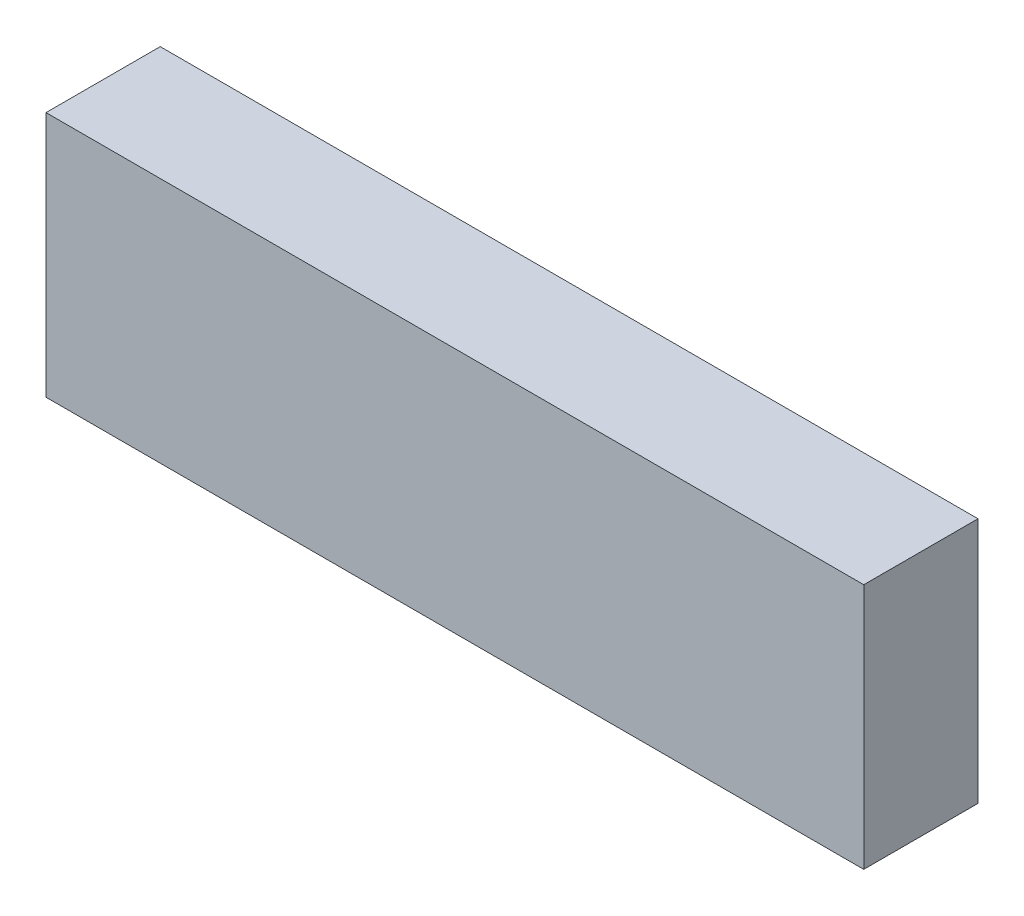
ISO-10303-21;
HEADER;
FILE_DESCRIPTION(('STEP AP214'),'2;1');
FILE_NAME('part.step','',(''),(''),'','','');
FILE_SCHEMA(('AUTOMOTIVE_DESIGN { 1 0 10303 214 1 1 1 1 }'));
ENDSEC;
DATA;
#1=APPLICATION_CONTEXT('core data for automotive mechanical design processes');
#2=APPLICATION_PROTOCOL_DEFINITION('international standard','automotive_design',2000,#1);
#3=PRODUCT_CONTEXT('',#1,'mechanical');
#4=PRODUCT('Part','Part','',(#3));
#5=PRODUCT_RELATED_PRODUCT_CATEGORY('part','',(#4));
#6=PRODUCT_DEFINITION_FORMATION('','',#4);
#7=PRODUCT_DEFINITION_CONTEXT('part definition',#1,'design');
#8=PRODUCT_DEFINITION('design','',#6,#7);
#9=PRODUCT_DEFINITION_SHAPE('','',#8);
#10=(LENGTH_UNIT() NAMED_UNIT(*) SI_UNIT(.MILLI.,.METRE.));
#11=(NAMED_UNIT(*) PLANE_ANGLE_UNIT() SI_UNIT($,.RADIAN.));
#12=(NAMED_UNIT(*) SI_UNIT($,.STERADIAN.) SOLID_ANGLE_UNIT());
#13=UNCERTAINTY_MEASURE_WITH_UNIT(LENGTH_MEASURE(1.E-05),#10,'distance_accuracy_value','');
#14=(GEOMETRIC_REPRESENTATION_CONTEXT(3) GLOBAL_UNCERTAINTY_ASSIGNED_CONTEXT((#13)) GLOBAL_UNIT_ASSIGNED_CONTEXT((#10,
#11,#12)) REPRESENTATION_CONTEXT('',''));
#15=CARTESIAN_POINT('',(0.,0.,0.));
#16=DIRECTION('',(0.,0.,1.));
#17=DIRECTION('',(1.,0.,0.));
#18=AXIS2_PLACEMENT_3D('',#15,#16,#17);
#19=CARTESIAN_POINT('',(68.,-20.5,9.5));
#20=DIRECTION('',(-1.,0.,0.));
#21=DIRECTION('',(0.,0.,1.));
#22=AXIS2_PLACEMENT_3D('',#19,#20,#21);
#23=PLANE('',#22);
#24=DIRECTION('',(0.,1.,0.));
#25=VECTOR('',#24,1.);
#26=CARTESIAN_POINT('',(68.,-20.5,-9.5));
#27=LINE('',#26,#25);
#28=CARTESIAN_POINT('',(68.,-20.5,-9.5));
#29=VERTEX_POINT('',#28);
#30=CARTESIAN_POINT('',(68.,20.5,-9.5));
#31=VERTEX_POINT('',#30);
#32=EDGE_CURVE('E99',#29,#31,#27,.T.);
#33=ORIENTED_EDGE('',*,*,#32,.T.);
#34=DIRECTION('',(0.,0.,-1.));
#35=VECTOR('',#34,1.);
#36=CARTESIAN_POINT('',(68.,20.5,9.5));
#37=LINE('',#36,#35);
#38=CARTESIAN_POINT('',(68.,20.5,9.5));
#39=VERTEX_POINT('',#38);
#40=EDGE_CURVE('E11',#39,#31,#37,.T.);
#41=ORIENTED_EDGE('',*,*,#40,.F.);
#42=DIRECTION('',(0.,1.,0.));
#43=VECTOR('',#42,1.);
#44=CARTESIAN_POINT('',(68.,-20.5,9.5));
#45=LINE('',#44,#43);
#46=CARTESIAN_POINT('',(68.,-20.5,9.5));
#47=VERTEX_POINT('',#46);
#48=EDGE_CURVE('E87',#47,#39,#45,.T.);
#49=ORIENTED_EDGE('',*,*,#48,.F.);
#50=DIRECTION('',(0.,0.,-1.));
#51=VECTOR('',#50,1.);
#52=CARTESIAN_POINT('',(68.,-20.5,9.5));
#53=LINE('',#52,#51);
#54=EDGE_CURVE('E95',#47,#29,#53,.T.);
#55=ORIENTED_EDGE('',*,*,#54,.T.);
#56=EDGE_LOOP('',(#33,#41,#49,#55));
#57=FACE_BOUND('',#56,.T.);
#58=ADVANCED_FACE('F36',(#57),#23,.F.);
#59=CARTESIAN_POINT('',(-68.,20.5,9.5));
#60=DIRECTION('',(0.,-1.,0.));
#61=DIRECTION('',(0.,0.,-1.));
#62=AXIS2_PLACEMENT_3D('',#59,#60,#61);
#63=PLANE('',#62);
#64=DIRECTION('',(-1.,0.,0.));
#65=VECTOR('',#64,1.);
#66=CARTESIAN_POINT('',(-68.,20.5,-9.5));
#67=LINE('',#66,#65);
#68=CARTESIAN_POINT('',(-68.,20.5,-9.5));
#69=VERTEX_POINT('',#68);
#70=EDGE_CURVE('E91',#31,#69,#67,.T.);
#71=ORIENTED_EDGE('',*,*,#70,.T.);
#72=DIRECTION('',(0.,0.,-1.));
#73=VECTOR('',#72,1.);
#74=CARTESIAN_POINT('',(-68.,20.5,9.5));
#75=LINE('',#74,#73);
#76=CARTESIAN_POINT('',(-68.,20.5,9.5));
#77=VERTEX_POINT('',#76);
#78=EDGE_CURVE('E44',#77,#69,#75,.T.);
#79=ORIENTED_EDGE('',*,*,#78,.F.);
#80=DIRECTION('',(-1.,0.,0.));
#81=VECTOR('',#80,1.);
#82=CARTESIAN_POINT('',(-68.,20.5,9.5));
#83=LINE('',#82,#81);
#84=EDGE_CURVE('E82',#39,#77,#83,.T.);
#85=ORIENTED_EDGE('',*,*,#84,.F.);
#86=ORIENTED_EDGE('',*,*,#40,.T.);
#87=EDGE_LOOP('',(#71,#79,#85,#86));
#88=FACE_BOUND('',#87,.T.);
#89=ADVANCED_FACE('F90',(#88),#63,.F.);
#90=CARTESIAN_POINT('',(-68.,-20.5,9.5));
#91=DIRECTION('',(1.,0.,0.));
#92=DIRECTION('',(0.,0.,-1.));
#93=AXIS2_PLACEMENT_3D('',#90,#91,#92);
#94=PLANE('',#93);
#95=DIRECTION('',(0.,-1.,0.));
#96=VECTOR('',#95,1.);
#97=CARTESIAN_POINT('',(-68.,-20.5,-9.5));
#98=LINE('',#97,#96);
#99=CARTESIAN_POINT('',(-68.,-20.5,-9.5));
#100=VERTEX_POINT('',#99);
#101=EDGE_CURVE('E69',#69,#100,#98,.T.);
#102=ORIENTED_EDGE('',*,*,#101,.T.);
#103=DIRECTION('',(0.,0.,-1.));
#104=VECTOR('',#103,1.);
#105=CARTESIAN_POINT('',(-68.,-20.5,9.5));
#106=LINE('',#105,#104);
#107=CARTESIAN_POINT('',(-68.,-20.5,9.5));
#108=VERTEX_POINT('',#107);
#109=EDGE_CURVE('E92',#108,#100,#106,.T.);
#110=ORIENTED_EDGE('',*,*,#109,.F.);
#111=DIRECTION('',(0.,-1.,0.));
#112=VECTOR('',#111,1.);
#113=CARTESIAN_POINT('',(-68.,-20.5,9.5));
#114=LINE('',#113,#112);
#115=EDGE_CURVE('E85',#77,#108,#114,.T.);
#116=ORIENTED_EDGE('',*,*,#115,.F.);
#117=ORIENTED_EDGE('',*,*,#78,.T.);
#118=EDGE_LOOP('',(#102,#110,#116,#117));
#119=FACE_BOUND('',#118,.T.);
#120=ADVANCED_FACE('F93',(#119),#94,.F.);
#121=CARTESIAN_POINT('',(-68.,-20.5,9.5));
#122=DIRECTION('',(0.,1.,0.));
#123=DIRECTION('',(0.,0.,1.));
#124=AXIS2_PLACEMENT_3D('',#121,#122,#123);
#125=PLANE('',#124);
#126=DIRECTION('',(1.,0.,0.));
#127=VECTOR('',#126,1.);
#128=CARTESIAN_POINT('',(-68.,-20.5,-9.5));
#129=LINE('',#128,#127);
#130=EDGE_CURVE('E75',#100,#29,#129,.T.);
#131=ORIENTED_EDGE('',*,*,#130,.T.);
#132=ORIENTED_EDGE('',*,*,#54,.F.);
#133=DIRECTION('',(1.,0.,0.));
#134=VECTOR('',#133,1.);
#135=CARTESIAN_POINT('',(-68.,-20.5,9.5));
#136=LINE('',#135,#134);
#137=EDGE_CURVE('E52',#108,#47,#136,.T.);
#138=ORIENTED_EDGE('',*,*,#137,.F.);
#139=ORIENTED_EDGE('',*,*,#109,.T.);
#140=EDGE_LOOP('',(#131,#132,#138,#139));
#141=FACE_BOUND('',#140,.T.);
#142=ADVANCED_FACE('F106',(#141),#125,.F.);
#143=CARTESIAN_POINT('',(0.,0.,9.5));
#144=DIRECTION('',(0.,0.,-1.));
#145=DIRECTION('',(-1.,0.,0.));
#146=AXIS2_PLACEMENT_3D('',#143,#144,#145);
#147=PLANE('',#146);
#148=ORIENTED_EDGE('',*,*,#48,.T.);
#149=ORIENTED_EDGE('',*,*,#84,.T.);
#150=ORIENTED_EDGE('',*,*,#115,.T.);
#151=ORIENTED_EDGE('',*,*,#137,.T.);
#152=EDGE_LOOP('',(#148,#149,#150,#151));
#153=FACE_BOUND('',#152,.T.);
#154=ADVANCED_FACE('F83',(#153),#147,.F.);
#155=CARTESIAN_POINT('',(0.,0.,-9.5));
#156=DIRECTION('',(0.,0.,-1.));
#157=DIRECTION('',(-1.,0.,0.));
#158=AXIS2_PLACEMENT_3D('',#155,#156,#157);
#159=PLANE('',#158);
#160=ORIENTED_EDGE('',*,*,#32,.F.);
#161=ORIENTED_EDGE('',*,*,#130,.F.);
#162=ORIENTED_EDGE('',*,*,#101,.F.);
#163=ORIENTED_EDGE('',*,*,#70,.F.);
#164=EDGE_LOOP('',(#160,#161,#162,#163));
#165=FACE_BOUND('',#164,.T.);
#166=ADVANCED_FACE('F109',(#165),#159,.T.);
#167=CLOSED_SHELL('',(#58,#89,#120,#142,#154,#166));
#168=MANIFOLD_SOLID_BREP('B2',#167);
#169=ADVANCED_BREP_SHAPE_REPRESENTATION('',(#18,#168),#14);
#170=SHAPE_DEFINITION_REPRESENTATION(#9,#169);
ENDSEC;
END-ISO-10303-21;
